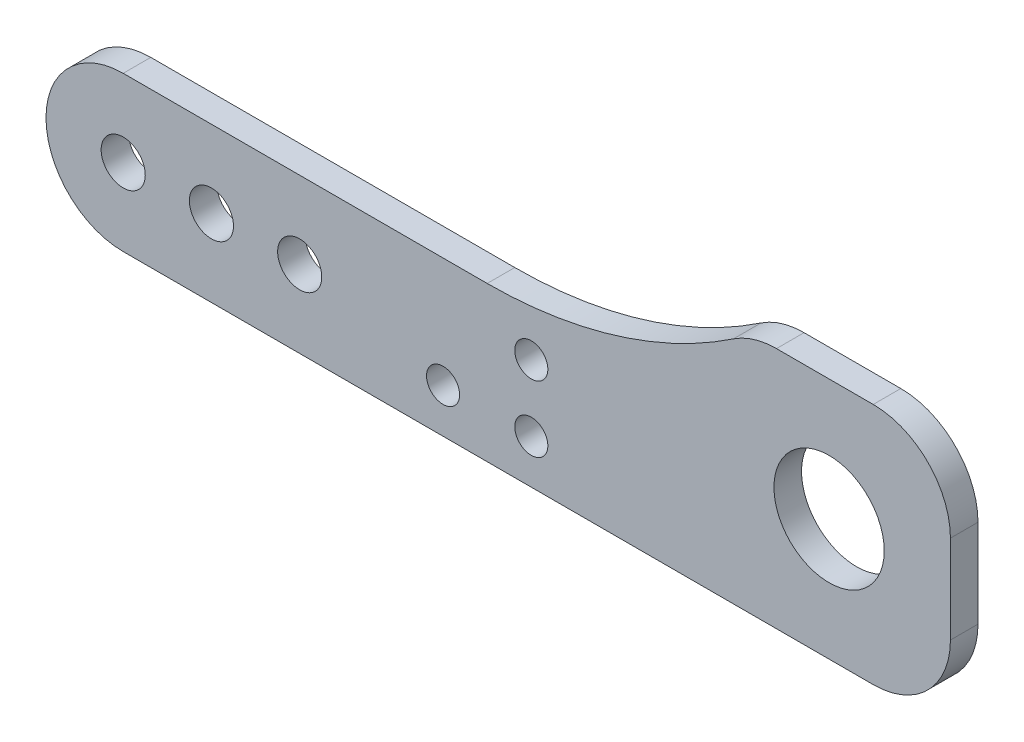
ISO-10303-21;
HEADER;
FILE_DESCRIPTION(('STEP AP214'),'2;1');
FILE_NAME('part.step','',(''),(''),'','','');
FILE_SCHEMA(('AUTOMOTIVE_DESIGN { 1 0 10303 214 1 1 1 1 }'));
ENDSEC;
DATA;
#1=APPLICATION_CONTEXT('core data for automotive mechanical design processes');
#2=APPLICATION_PROTOCOL_DEFINITION('international standard','automotive_design',2000,#1);
#3=PRODUCT_CONTEXT('',#1,'mechanical');
#4=PRODUCT('Part','Part','',(#3));
#5=PRODUCT_RELATED_PRODUCT_CATEGORY('part','',(#4));
#6=PRODUCT_DEFINITION_FORMATION('','',#4);
#7=PRODUCT_DEFINITION_CONTEXT('part definition',#1,'design');
#8=PRODUCT_DEFINITION('design','',#6,#7);
#9=PRODUCT_DEFINITION_SHAPE('','',#8);
#10=(LENGTH_UNIT() NAMED_UNIT(*) SI_UNIT(.MILLI.,.METRE.));
#11=(NAMED_UNIT(*) PLANE_ANGLE_UNIT() SI_UNIT($,.RADIAN.));
#12=(NAMED_UNIT(*) SI_UNIT($,.STERADIAN.) SOLID_ANGLE_UNIT());
#13=UNCERTAINTY_MEASURE_WITH_UNIT(LENGTH_MEASURE(1.E-05),#10,'distance_accuracy_value','');
#14=(GEOMETRIC_REPRESENTATION_CONTEXT(3) GLOBAL_UNCERTAINTY_ASSIGNED_CONTEXT((#13)) GLOBAL_UNIT_ASSIGNED_CONTEXT((#10,
#11,#12)) REPRESENTATION_CONTEXT('',''));
#15=CARTESIAN_POINT('',(0.,0.,0.));
#16=DIRECTION('',(0.,0.,1.));
#17=DIRECTION('',(1.,0.,0.));
#18=AXIS2_PLACEMENT_3D('',#15,#16,#17);
#19=CARTESIAN_POINT('',(68.,0.,2.5));
#20=DIRECTION('',(0.,0.,-1.));
#21=DIRECTION('',(-1.,0.,0.));
#22=AXIS2_PLACEMENT_3D('',#19,#20,#21);
#23=CYLINDRICAL_SURFACE('',#22,7.);
#24=CARTESIAN_POINT('',(68.,0.,0.));
#25=DIRECTION('',(0.,0.,1.));
#26=DIRECTION('',(1.,0.,0.));
#27=AXIS2_PLACEMENT_3D('',#24,#25,#26);
#28=CIRCLE('',#27,7.);
#29=CARTESIAN_POINT('',(68.,-6.99999999999999,0.));
#30=VERTEX_POINT('',#29);
#31=CARTESIAN_POINT('',(75.,0.,0.));
#32=VERTEX_POINT('',#31);
#33=EDGE_CURVE('E146',#30,#32,#28,.T.);
#34=ORIENTED_EDGE('',*,*,#33,.T.);
#35=DIRECTION('',(0.,0.,-1.));
#36=VECTOR('',#35,1.);
#37=CARTESIAN_POINT('',(75.,0.,2.5));
#38=LINE('',#37,#36);
#39=CARTESIAN_POINT('',(75.,0.,2.5));
#40=VERTEX_POINT('',#39);
#41=EDGE_CURVE('E11',#40,#32,#38,.T.);
#42=ORIENTED_EDGE('',*,*,#41,.F.);
#43=CARTESIAN_POINT('',(68.,0.,2.5));
#44=DIRECTION('',(0.,0.,1.));
#45=DIRECTION('',(1.,0.,0.));
#46=AXIS2_PLACEMENT_3D('',#43,#44,#45);
#47=CIRCLE('',#46,7.);
#48=CARTESIAN_POINT('',(68.,-6.99999999999999,2.5));
#49=VERTEX_POINT('',#48);
#50=EDGE_CURVE('E172',#49,#40,#47,.T.);
#51=ORIENTED_EDGE('',*,*,#50,.F.);
#52=DIRECTION('',(0.,0.,-1.));
#53=VECTOR('',#52,1.);
#54=CARTESIAN_POINT('',(68.,-6.99999999999999,2.5));
#55=LINE('',#54,#53);
#56=EDGE_CURVE('E142',#49,#30,#55,.T.);
#57=ORIENTED_EDGE('',*,*,#56,.T.);
#58=EDGE_LOOP('',(#34,#42,#51,#57));
#59=FACE_BOUND('',#58,.T.);
#60=ADVANCED_FACE('F39',(#59),#23,.T.);
#61=CARTESIAN_POINT('',(75.,0.,2.5));
#62=DIRECTION('',(-1.,0.,0.));
#63=DIRECTION('',(0.,-1.,0.));
#64=AXIS2_PLACEMENT_3D('',#61,#62,#63);
#65=PLANE('',#64);
#66=DIRECTION('',(0.,1.,0.));
#67=VECTOR('',#66,1.);
#68=CARTESIAN_POINT('',(75.,0.,0.));
#69=LINE('',#68,#67);
#70=CARTESIAN_POINT('',(75.,8.00000000000001,0.));
#71=VERTEX_POINT('',#70);
#72=EDGE_CURVE('E150',#32,#71,#69,.T.);
#73=ORIENTED_EDGE('',*,*,#72,.T.);
#74=DIRECTION('',(0.,0.,-1.));
#75=VECTOR('',#74,1.);
#76=CARTESIAN_POINT('',(75.,8.00000000000001,2.5));
#77=LINE('',#76,#75);
#78=CARTESIAN_POINT('',(75.,8.00000000000001,2.5));
#79=VERTEX_POINT('',#78);
#80=EDGE_CURVE('E48',#79,#71,#77,.T.);
#81=ORIENTED_EDGE('',*,*,#80,.F.);
#82=DIRECTION('',(0.,1.,0.));
#83=VECTOR('',#82,1.);
#84=CARTESIAN_POINT('',(75.,0.,2.5));
#85=LINE('',#84,#83);
#86=EDGE_CURVE('E102',#40,#79,#85,.T.);
#87=ORIENTED_EDGE('',*,*,#86,.F.);
#88=ORIENTED_EDGE('',*,*,#41,.T.);
#89=EDGE_LOOP('',(#73,#81,#87,#88));
#90=FACE_BOUND('',#89,.T.);
#91=ADVANCED_FACE('F316',(#90),#65,.F.);
#92=CARTESIAN_POINT('',(68.,8.00000000000001,2.5));
#93=DIRECTION('',(0.,0.,-1.));
#94=DIRECTION('',(-1.,0.,0.));
#95=AXIS2_PLACEMENT_3D('',#92,#93,#94);
#96=CYLINDRICAL_SURFACE('',#95,7.);
#97=CARTESIAN_POINT('',(68.,8.00000000000001,0.));
#98=DIRECTION('',(0.,0.,1.));
#99=DIRECTION('',(-1.,0.,0.));
#100=AXIS2_PLACEMENT_3D('',#97,#98,#99);
#101=CIRCLE('',#100,7.);
#102=CARTESIAN_POINT('',(68.,15.,0.));
#103=VERTEX_POINT('',#102);
#104=EDGE_CURVE('E154',#71,#103,#101,.T.);
#105=ORIENTED_EDGE('',*,*,#104,.T.);
#106=DIRECTION('',(0.,0.,-1.));
#107=VECTOR('',#106,1.);
#108=CARTESIAN_POINT('',(68.,15.,2.5));
#109=LINE('',#108,#107);
#110=CARTESIAN_POINT('',(68.,15.,2.5));
#111=VERTEX_POINT('',#110);
#112=EDGE_CURVE('E187',#111,#103,#109,.T.);
#113=ORIENTED_EDGE('',*,*,#112,.F.);
#114=CARTESIAN_POINT('',(68.,8.00000000000001,2.5));
#115=DIRECTION('',(0.,0.,1.));
#116=DIRECTION('',(-1.,0.,0.));
#117=AXIS2_PLACEMENT_3D('',#114,#115,#116);
#118=CIRCLE('',#117,7.);
#119=EDGE_CURVE('E197',#79,#111,#118,.T.);
#120=ORIENTED_EDGE('',*,*,#119,.F.);
#121=ORIENTED_EDGE('',*,*,#80,.T.);
#122=EDGE_LOOP('',(#105,#113,#120,#121));
#123=FACE_BOUND('',#122,.T.);
#124=ADVANCED_FACE('F195',(#123),#96,.T.);
#125=CARTESIAN_POINT('',(59.229754097208,15.,2.5));
#126=DIRECTION('',(0.,-1.,0.));
#127=DIRECTION('',(0.,0.,-1.));
#128=AXIS2_PLACEMENT_3D('',#125,#126,#127);
#129=PLANE('',#128);
#130=DIRECTION('',(-1.,0.,0.));
#131=VECTOR('',#130,1.);
#132=CARTESIAN_POINT('',(59.229754097208,15.,0.));
#133=LINE('',#132,#131);
#134=CARTESIAN_POINT('',(59.229754097208,15.,0.));
#135=VERTEX_POINT('',#134);
#136=EDGE_CURVE('E157',#103,#135,#133,.T.);
#137=ORIENTED_EDGE('',*,*,#136,.T.);
#138=DIRECTION('',(0.,0.,-1.));
#139=VECTOR('',#138,1.);
#140=CARTESIAN_POINT('',(59.229754097208,15.,2.5));
#141=LINE('',#140,#139);
#142=CARTESIAN_POINT('',(59.229754097208,15.,2.5));
#143=VERTEX_POINT('',#142);
#144=EDGE_CURVE('E183',#143,#135,#141,.T.);
#145=ORIENTED_EDGE('',*,*,#144,.F.);
#146=DIRECTION('',(-1.,0.,0.));
#147=VECTOR('',#146,1.);
#148=CARTESIAN_POINT('',(59.229754097208,15.,2.5));
#149=LINE('',#148,#147);
#150=EDGE_CURVE('E214',#111,#143,#149,.T.);
#151=ORIENTED_EDGE('',*,*,#150,.F.);
#152=ORIENTED_EDGE('',*,*,#112,.T.);
#153=EDGE_LOOP('',(#137,#145,#151,#152));
#154=FACE_BOUND('',#153,.T.);
#155=ADVANCED_FACE('F206',(#154),#129,.F.);
#156=CARTESIAN_POINT('',(59.229754097208,8.00000000000001,2.5));
#157=DIRECTION('',(0.,0.,-1.));
#158=DIRECTION('',(-1.,0.,0.));
#159=AXIS2_PLACEMENT_3D('',#156,#157,#158);
#160=CYLINDRICAL_SURFACE('',#159,7.);
#161=CARTESIAN_POINT('',(59.229754097208,8.00000000000001,0.));
#162=DIRECTION('',(0.,0.,1.));
#163=DIRECTION('',(1.,0.,0.));
#164=AXIS2_PLACEMENT_3D('',#161,#162,#163);
#165=CIRCLE('',#164,7.);
#166=CARTESIAN_POINT('',(55.3231949763472,13.8085106382979,0.));
#167=VERTEX_POINT('',#166);
#168=EDGE_CURVE('E160',#135,#167,#165,.T.);
#169=ORIENTED_EDGE('',*,*,#168,.T.);
#170=DIRECTION('',(0.,0.,-1.));
#171=VECTOR('',#170,1.);
#172=CARTESIAN_POINT('',(55.3231949763472,13.8085106382979,2.5));
#173=LINE('',#172,#171);
#174=CARTESIAN_POINT('',(55.3231949763472,13.8085106382979,2.5));
#175=VERTEX_POINT('',#174);
#176=EDGE_CURVE('E179',#175,#167,#173,.T.);
#177=ORIENTED_EDGE('',*,*,#176,.F.);
#178=CARTESIAN_POINT('',(59.229754097208,8.00000000000001,2.5));
#179=DIRECTION('',(0.,0.,1.));
#180=DIRECTION('',(1.,0.,0.));
#181=AXIS2_PLACEMENT_3D('',#178,#179,#180);
#182=CIRCLE('',#181,7.);
#183=EDGE_CURVE('E212',#143,#175,#182,.T.);
#184=ORIENTED_EDGE('',*,*,#183,.F.);
#185=ORIENTED_EDGE('',*,*,#144,.T.);
#186=EDGE_LOOP('',(#169,#177,#184,#185));
#187=FACE_BOUND('',#186,.T.);
#188=ADVANCED_FACE('F210',(#187),#160,.T.);
#189=CARTESIAN_POINT('',(33.,47.,2.5));
#190=DIRECTION('',(0.,0.,-1.));
#191=DIRECTION('',(-1.,0.,0.));
#192=AXIS2_PLACEMENT_3D('',#189,#190,#191);
#193=CYLINDRICAL_SURFACE('',#192,40.);
#194=CARTESIAN_POINT('',(33.,47.,0.));
#195=DIRECTION('',(0.,0.,-1.));
#196=DIRECTION('',(1.,0.,0.));
#197=AXIS2_PLACEMENT_3D('',#194,#195,#196);
#198=CIRCLE('',#197,40.);
#199=CARTESIAN_POINT('',(33.,7.,0.));
#200=VERTEX_POINT('',#199);
#201=EDGE_CURVE('E163',#167,#200,#198,.T.);
#202=ORIENTED_EDGE('',*,*,#201,.T.);
#203=DIRECTION('',(0.,0.,-1.));
#204=VECTOR('',#203,1.);
#205=CARTESIAN_POINT('',(33.,7.,2.5));
#206=LINE('',#205,#204);
#207=CARTESIAN_POINT('',(33.,7.,2.5));
#208=VERTEX_POINT('',#207);
#209=EDGE_CURVE('E135',#208,#200,#206,.T.);
#210=ORIENTED_EDGE('',*,*,#209,.F.);
#211=CARTESIAN_POINT('',(33.,47.,2.5));
#212=DIRECTION('',(0.,0.,-1.));
#213=DIRECTION('',(1.,0.,0.));
#214=AXIS2_PLACEMENT_3D('',#211,#212,#213);
#215=CIRCLE('',#214,40.);
#216=EDGE_CURVE('E124',#175,#208,#215,.T.);
#217=ORIENTED_EDGE('',*,*,#216,.F.);
#218=ORIENTED_EDGE('',*,*,#176,.T.);
#219=EDGE_LOOP('',(#202,#210,#217,#218));
#220=FACE_BOUND('',#219,.T.);
#221=ADVANCED_FACE('F324',(#220),#193,.F.);
#222=CARTESIAN_POINT('',(0.,7.,2.5));
#223=DIRECTION('',(0.,-1.,0.));
#224=DIRECTION('',(1.,0.,0.));
#225=AXIS2_PLACEMENT_3D('',#222,#223,#224);
#226=PLANE('',#225);
#227=DIRECTION('',(-1.,0.,0.));
#228=VECTOR('',#227,1.);
#229=CARTESIAN_POINT('',(0.,7.,0.));
#230=LINE('',#229,#228);
#231=CARTESIAN_POINT('',(0.,7.,0.));
#232=VERTEX_POINT('',#231);
#233=EDGE_CURVE('E133',#200,#232,#230,.T.);
#234=ORIENTED_EDGE('',*,*,#233,.T.);
#235=DIRECTION('',(0.,0.,-1.));
#236=VECTOR('',#235,1.);
#237=CARTESIAN_POINT('',(0.,7.,2.5));
#238=LINE('',#237,#236);
#239=CARTESIAN_POINT('',(0.,7.,2.5));
#240=VERTEX_POINT('',#239);
#241=EDGE_CURVE('E130',#240,#232,#238,.T.);
#242=ORIENTED_EDGE('',*,*,#241,.F.);
#243=DIRECTION('',(-1.,0.,0.));
#244=VECTOR('',#243,1.);
#245=CARTESIAN_POINT('',(0.,7.,2.5));
#246=LINE('',#245,#244);
#247=EDGE_CURVE('E118',#208,#240,#246,.T.);
#248=ORIENTED_EDGE('',*,*,#247,.F.);
#249=ORIENTED_EDGE('',*,*,#209,.T.);
#250=EDGE_LOOP('',(#234,#242,#248,#249));
#251=FACE_BOUND('',#250,.T.);
#252=ADVANCED_FACE('F131',(#251),#226,.F.);
#253=CARTESIAN_POINT('',(0.,0.,2.5));
#254=DIRECTION('',(0.,0.,-1.));
#255=DIRECTION('',(-1.,0.,0.));
#256=AXIS2_PLACEMENT_3D('',#253,#254,#255);
#257=CYLINDRICAL_SURFACE('',#256,7.);
#258=CARTESIAN_POINT('',(0.,0.,0.));
#259=DIRECTION('',(0.,0.,1.));
#260=DIRECTION('',(-1.,0.,0.));
#261=AXIS2_PLACEMENT_3D('',#258,#259,#260);
#262=CIRCLE('',#261,7.);
#263=CARTESIAN_POINT('',(0.,-7.,0.));
#264=VERTEX_POINT('',#263);
#265=EDGE_CURVE('E88',#232,#264,#262,.T.);
#266=ORIENTED_EDGE('',*,*,#265,.T.);
#267=DIRECTION('',(0.,0.,-1.));
#268=VECTOR('',#267,1.);
#269=CARTESIAN_POINT('',(0.,-7.,2.5));
#270=LINE('',#269,#268);
#271=CARTESIAN_POINT('',(0.,-7.,2.5));
#272=VERTEX_POINT('',#271);
#273=EDGE_CURVE('E136',#272,#264,#270,.T.);
#274=ORIENTED_EDGE('',*,*,#273,.F.);
#275=CARTESIAN_POINT('',(0.,0.,2.5));
#276=DIRECTION('',(0.,0.,1.));
#277=DIRECTION('',(-1.,0.,0.));
#278=AXIS2_PLACEMENT_3D('',#275,#276,#277);
#279=CIRCLE('',#278,7.);
#280=EDGE_CURVE('E122',#240,#272,#279,.T.);
#281=ORIENTED_EDGE('',*,*,#280,.F.);
#282=ORIENTED_EDGE('',*,*,#241,.T.);
#283=EDGE_LOOP('',(#266,#274,#281,#282));
#284=FACE_BOUND('',#283,.T.);
#285=ADVANCED_FACE('F138',(#284),#257,.T.);
#286=CARTESIAN_POINT('',(68.,-6.99999999999999,2.5));
#287=DIRECTION('',(0.,1.,0.));
#288=DIRECTION('',(-1.,0.,0.));
#289=AXIS2_PLACEMENT_3D('',#286,#287,#288);
#290=PLANE('',#289);
#291=DIRECTION('',(1.,0.,0.));
#292=VECTOR('',#291,1.);
#293=CARTESIAN_POINT('',(68.,-6.99999999999999,0.));
#294=LINE('',#293,#292);
#295=EDGE_CURVE('E94',#264,#30,#294,.T.);
#296=ORIENTED_EDGE('',*,*,#295,.T.);
#297=ORIENTED_EDGE('',*,*,#56,.F.);
#298=DIRECTION('',(1.,0.,0.));
#299=VECTOR('',#298,1.);
#300=CARTESIAN_POINT('',(68.,-6.99999999999999,2.5));
#301=LINE('',#300,#299);
#302=EDGE_CURVE('E56',#272,#49,#301,.T.);
#303=ORIENTED_EDGE('',*,*,#302,.F.);
#304=ORIENTED_EDGE('',*,*,#273,.T.);
#305=EDGE_LOOP('',(#296,#297,#303,#304));
#306=FACE_BOUND('',#305,.T.);
#307=ADVANCED_FACE('F307',(#306),#290,.F.);
#308=CARTESIAN_POINT('',(68.,0.,2.5));
#309=DIRECTION('',(0.,0.,1.));
#310=DIRECTION('',(1.,0.,0.));
#311=AXIS2_PLACEMENT_3D('',#308,#309,#310);
#312=PLANE('',#311);
#313=CARTESIAN_POINT('',(37.,2.99999999999984,2.5));
#314=DIRECTION('',(0.,0.,-1.));
#315=DIRECTION('',(-1.,0.,0.));
#316=AXIS2_PLACEMENT_3D('',#313,#314,#315);
#317=CIRCLE('',#316,1.5);
#318=CARTESIAN_POINT('',(35.5,2.99999999999984,2.5));
#319=VERTEX_POINT('',#318);
#320=EDGE_CURVE('E273',#319,#319,#317,.T.);
#321=ORIENTED_EDGE('',*,*,#320,.T.);
#322=EDGE_LOOP('',(#321));
#323=FACE_BOUND('',#322,.T.);
#324=CARTESIAN_POINT('',(37.,-3.00000000000016,2.5));
#325=DIRECTION('',(0.,0.,-1.));
#326=DIRECTION('',(-1.,0.,0.));
#327=AXIS2_PLACEMENT_3D('',#324,#325,#326);
#328=CIRCLE('',#327,1.5);
#329=CARTESIAN_POINT('',(35.5,-3.00000000000016,2.5));
#330=VERTEX_POINT('',#329);
#331=EDGE_CURVE('E265',#330,#330,#328,.T.);
#332=ORIENTED_EDGE('',*,*,#331,.T.);
#333=EDGE_LOOP('',(#332));
#334=FACE_BOUND('',#333,.T.);
#335=CARTESIAN_POINT('',(29.,-3.00000000000016,2.5));
#336=DIRECTION('',(0.,0.,-1.));
#337=DIRECTION('',(-1.,0.,0.));
#338=AXIS2_PLACEMENT_3D('',#335,#336,#337);
#339=CIRCLE('',#338,1.5);
#340=CARTESIAN_POINT('',(27.5,-3.00000000000016,2.5));
#341=VERTEX_POINT('',#340);
#342=EDGE_CURVE('E257',#341,#341,#339,.T.);
#343=ORIENTED_EDGE('',*,*,#342,.T.);
#344=EDGE_LOOP('',(#343));
#345=FACE_BOUND('',#344,.T.);
#346=CARTESIAN_POINT('',(64.,4.00000000000001,2.5));
#347=DIRECTION('',(0.,0.,1.));
#348=DIRECTION('',(1.,0.,0.));
#349=AXIS2_PLACEMENT_3D('',#346,#347,#348);
#350=CIRCLE('',#349,5.);
#351=CARTESIAN_POINT('',(69.,4.00000000000001,2.5));
#352=VERTEX_POINT('',#351);
#353=EDGE_CURVE('E253',#352,#352,#350,.T.);
#354=ORIENTED_EDGE('',*,*,#353,.F.);
#355=EDGE_LOOP('',(#354));
#356=FACE_BOUND('',#355,.T.);
#357=CARTESIAN_POINT('',(0.,0.,2.5));
#358=DIRECTION('',(0.,0.,1.));
#359=DIRECTION('',(1.,0.,0.));
#360=AXIS2_PLACEMENT_3D('',#357,#358,#359);
#361=CIRCLE('',#360,2.);
#362=CARTESIAN_POINT('',(2.,0.,2.5));
#363=VERTEX_POINT('',#362);
#364=EDGE_CURVE('E240',#363,#363,#361,.T.);
#365=ORIENTED_EDGE('',*,*,#364,.F.);
#366=EDGE_LOOP('',(#365));
#367=FACE_BOUND('',#366,.T.);
#368=CARTESIAN_POINT('',(8.,0.,2.5));
#369=DIRECTION('',(0.,0.,1.));
#370=DIRECTION('',(1.,0.,0.));
#371=AXIS2_PLACEMENT_3D('',#368,#369,#370);
#372=CIRCLE('',#371,2.);
#373=CARTESIAN_POINT('',(10.,0.,2.5));
#374=VERTEX_POINT('',#373);
#375=EDGE_CURVE('E230',#374,#374,#372,.T.);
#376=ORIENTED_EDGE('',*,*,#375,.F.);
#377=EDGE_LOOP('',(#376));
#378=FACE_BOUND('',#377,.T.);
#379=CARTESIAN_POINT('',(16.,0.,2.5));
#380=DIRECTION('',(0.,0.,1.));
#381=DIRECTION('',(1.,0.,0.));
#382=AXIS2_PLACEMENT_3D('',#379,#380,#381);
#383=CIRCLE('',#382,2.);
#384=CARTESIAN_POINT('',(18.,0.,2.5));
#385=VERTEX_POINT('',#384);
#386=EDGE_CURVE('E231',#385,#385,#383,.T.);
#387=ORIENTED_EDGE('',*,*,#386,.F.);
#388=EDGE_LOOP('',(#387));
#389=FACE_BOUND('',#388,.T.);
#390=ORIENTED_EDGE('',*,*,#50,.T.);
#391=ORIENTED_EDGE('',*,*,#86,.T.);
#392=ORIENTED_EDGE('',*,*,#119,.T.);
#393=ORIENTED_EDGE('',*,*,#150,.T.);
#394=ORIENTED_EDGE('',*,*,#183,.T.);
#395=ORIENTED_EDGE('',*,*,#216,.T.);
#396=ORIENTED_EDGE('',*,*,#247,.T.);
#397=ORIENTED_EDGE('',*,*,#280,.T.);
#398=ORIENTED_EDGE('',*,*,#302,.T.);
#399=EDGE_LOOP('',(#390,#391,#392,#393,#394,#395,#396,#397,#398));
#400=FACE_BOUND('',#399,.T.);
#401=ADVANCED_FACE('F120',(#323,#334,#345,#356,#367,#378,#389,#400),#312,.T.);
#402=CARTESIAN_POINT('',(68.,0.,0.));
#403=DIRECTION('',(0.,0.,1.));
#404=DIRECTION('',(1.,0.,0.));
#405=AXIS2_PLACEMENT_3D('',#402,#403,#404);
#406=PLANE('',#405);
#407=CARTESIAN_POINT('',(37.,2.99999999999984,0.));
#408=DIRECTION('',(0.,0.,-1.));
#409=DIRECTION('',(-1.,0.,0.));
#410=AXIS2_PLACEMENT_3D('',#407,#408,#409);
#411=CIRCLE('',#410,1.5);
#412=CARTESIAN_POINT('',(35.5,2.99999999999984,0.));
#413=VERTEX_POINT('',#412);
#414=EDGE_CURVE('E277',#413,#413,#411,.T.);
#415=ORIENTED_EDGE('',*,*,#414,.F.);
#416=EDGE_LOOP('',(#415));
#417=FACE_BOUND('',#416,.T.);
#418=CARTESIAN_POINT('',(37.,-3.00000000000016,0.));
#419=DIRECTION('',(0.,0.,-1.));
#420=DIRECTION('',(-1.,0.,0.));
#421=AXIS2_PLACEMENT_3D('',#418,#419,#420);
#422=CIRCLE('',#421,1.5);
#423=CARTESIAN_POINT('',(35.5,-3.00000000000016,0.));
#424=VERTEX_POINT('',#423);
#425=EDGE_CURVE('E269',#424,#424,#422,.T.);
#426=ORIENTED_EDGE('',*,*,#425,.F.);
#427=EDGE_LOOP('',(#426));
#428=FACE_BOUND('',#427,.T.);
#429=CARTESIAN_POINT('',(29.,-3.00000000000016,0.));
#430=DIRECTION('',(0.,0.,-1.));
#431=DIRECTION('',(-1.,0.,0.));
#432=AXIS2_PLACEMENT_3D('',#429,#430,#431);
#433=CIRCLE('',#432,1.5);
#434=CARTESIAN_POINT('',(27.5,-3.00000000000016,0.));
#435=VERTEX_POINT('',#434);
#436=EDGE_CURVE('E261',#435,#435,#433,.T.);
#437=ORIENTED_EDGE('',*,*,#436,.F.);
#438=EDGE_LOOP('',(#437));
#439=FACE_BOUND('',#438,.T.);
#440=CARTESIAN_POINT('',(64.,4.00000000000001,0.));
#441=DIRECTION('',(0.,0.,1.));
#442=DIRECTION('',(1.,0.,0.));
#443=AXIS2_PLACEMENT_3D('',#440,#441,#442);
#444=CIRCLE('',#443,5.);
#445=CARTESIAN_POINT('',(69.,4.00000000000001,0.));
#446=VERTEX_POINT('',#445);
#447=EDGE_CURVE('E235',#446,#446,#444,.F.);
#448=ORIENTED_EDGE('',*,*,#447,.F.);
#449=EDGE_LOOP('',(#448));
#450=FACE_BOUND('',#449,.T.);
#451=CARTESIAN_POINT('',(0.,0.,0.));
#452=DIRECTION('',(0.,0.,1.));
#453=DIRECTION('',(1.,0.,0.));
#454=AXIS2_PLACEMENT_3D('',#451,#452,#453);
#455=CIRCLE('',#454,2.);
#456=CARTESIAN_POINT('',(2.,0.,0.));
#457=VERTEX_POINT('',#456);
#458=EDGE_CURVE('E151',#457,#457,#455,.F.);
#459=ORIENTED_EDGE('',*,*,#458,.F.);
#460=EDGE_LOOP('',(#459));
#461=FACE_BOUND('',#460,.T.);
#462=CARTESIAN_POINT('',(8.,0.,0.));
#463=DIRECTION('',(0.,0.,1.));
#464=DIRECTION('',(1.,0.,0.));
#465=AXIS2_PLACEMENT_3D('',#462,#463,#464);
#466=CIRCLE('',#465,2.);
#467=CARTESIAN_POINT('',(10.,0.,0.));
#468=VERTEX_POINT('',#467);
#469=EDGE_CURVE('E236',#468,#468,#466,.F.);
#470=ORIENTED_EDGE('',*,*,#469,.F.);
#471=EDGE_LOOP('',(#470));
#472=FACE_BOUND('',#471,.T.);
#473=CARTESIAN_POINT('',(16.,0.,0.));
#474=DIRECTION('',(0.,0.,1.));
#475=DIRECTION('',(1.,0.,0.));
#476=AXIS2_PLACEMENT_3D('',#473,#474,#475);
#477=CIRCLE('',#476,2.);
#478=CARTESIAN_POINT('',(18.,0.,0.));
#479=VERTEX_POINT('',#478);
#480=EDGE_CURVE('E226',#479,#479,#477,.F.);
#481=ORIENTED_EDGE('',*,*,#480,.F.);
#482=EDGE_LOOP('',(#481));
#483=FACE_BOUND('',#482,.T.);
#484=ORIENTED_EDGE('',*,*,#33,.F.);
#485=ORIENTED_EDGE('',*,*,#295,.F.);
#486=ORIENTED_EDGE('',*,*,#265,.F.);
#487=ORIENTED_EDGE('',*,*,#233,.F.);
#488=ORIENTED_EDGE('',*,*,#201,.F.);
#489=ORIENTED_EDGE('',*,*,#168,.F.);
#490=ORIENTED_EDGE('',*,*,#136,.F.);
#491=ORIENTED_EDGE('',*,*,#104,.F.);
#492=ORIENTED_EDGE('',*,*,#72,.F.);
#493=EDGE_LOOP('',(#484,#485,#486,#487,#488,#489,#490,#491,#492));
#494=FACE_BOUND('',#493,.T.);
#495=ADVANCED_FACE('F201',(#417,#428,#439,#450,#461,#472,#483,#494),#406,.F.);
#496=CARTESIAN_POINT('',(16.,0.,-5.65685424949239));
#497=DIRECTION('',(0.,0.,1.));
#498=DIRECTION('',(1.,0.,0.));
#499=AXIS2_PLACEMENT_3D('',#496,#497,#498);
#500=CYLINDRICAL_SURFACE('',#499,2.);
#501=ORIENTED_EDGE('',*,*,#480,.T.);
#502=EDGE_LOOP('',(#501));
#503=FACE_BOUND('',#502,.T.);
#504=ORIENTED_EDGE('',*,*,#386,.T.);
#505=EDGE_LOOP('',(#504));
#506=FACE_BOUND('',#505,.T.);
#507=ADVANCED_FACE('F286',(#503,#506),#500,.F.);
#508=CARTESIAN_POINT('',(8.,0.,-5.65685424949239));
#509=DIRECTION('',(0.,0.,1.));
#510=DIRECTION('',(1.,0.,0.));
#511=AXIS2_PLACEMENT_3D('',#508,#509,#510);
#512=CYLINDRICAL_SURFACE('',#511,2.);
#513=ORIENTED_EDGE('',*,*,#469,.T.);
#514=EDGE_LOOP('',(#513));
#515=FACE_BOUND('',#514,.T.);
#516=ORIENTED_EDGE('',*,*,#375,.T.);
#517=EDGE_LOOP('',(#516));
#518=FACE_BOUND('',#517,.T.);
#519=ADVANCED_FACE('F302',(#515,#518),#512,.F.);
#520=CARTESIAN_POINT('',(0.,0.,-5.65685424949239));
#521=DIRECTION('',(0.,0.,1.));
#522=DIRECTION('',(1.,0.,0.));
#523=AXIS2_PLACEMENT_3D('',#520,#521,#522);
#524=CYLINDRICAL_SURFACE('',#523,2.);
#525=ORIENTED_EDGE('',*,*,#458,.T.);
#526=EDGE_LOOP('',(#525));
#527=FACE_BOUND('',#526,.T.);
#528=ORIENTED_EDGE('',*,*,#364,.T.);
#529=EDGE_LOOP('',(#528));
#530=FACE_BOUND('',#529,.T.);
#531=ADVANCED_FACE('F390',(#527,#530),#524,.F.);
#532=CARTESIAN_POINT('',(64.,4.00000000000001,-14.142135623731));
#533=DIRECTION('',(0.,0.,1.));
#534=DIRECTION('',(1.,0.,0.));
#535=AXIS2_PLACEMENT_3D('',#532,#533,#534);
#536=CYLINDRICAL_SURFACE('',#535,5.);
#537=ORIENTED_EDGE('',*,*,#447,.T.);
#538=EDGE_LOOP('',(#537));
#539=FACE_BOUND('',#538,.T.);
#540=ORIENTED_EDGE('',*,*,#353,.T.);
#541=EDGE_LOOP('',(#540));
#542=FACE_BOUND('',#541,.T.);
#543=ADVANCED_FACE('F400',(#539,#542),#536,.F.);
#544=CARTESIAN_POINT('',(29.,-3.00000000000016,0.));
#545=DIRECTION('',(0.,0.,-1.));
#546=DIRECTION('',(-1.,0.,0.));
#547=AXIS2_PLACEMENT_3D('',#544,#545,#546);
#548=CYLINDRICAL_SURFACE('',#547,1.5);
#549=ORIENTED_EDGE('',*,*,#342,.F.);
#550=EDGE_LOOP('',(#549));
#551=FACE_BOUND('',#550,.T.);
#552=ORIENTED_EDGE('',*,*,#436,.T.);
#553=EDGE_LOOP('',(#552));
#554=FACE_BOUND('',#553,.T.);
#555=ADVANCED_FACE('F409',(#551,#554),#548,.F.);
#556=CARTESIAN_POINT('',(37.,-3.00000000000016,0.));
#557=DIRECTION('',(0.,0.,-1.));
#558=DIRECTION('',(-1.,0.,0.));
#559=AXIS2_PLACEMENT_3D('',#556,#557,#558);
#560=CYLINDRICAL_SURFACE('',#559,1.5);
#561=ORIENTED_EDGE('',*,*,#331,.F.);
#562=EDGE_LOOP('',(#561));
#563=FACE_BOUND('',#562,.T.);
#564=ORIENTED_EDGE('',*,*,#425,.T.);
#565=EDGE_LOOP('',(#564));
#566=FACE_BOUND('',#565,.T.);
#567=ADVANCED_FACE('F428',(#563,#566),#560,.F.);
#568=CARTESIAN_POINT('',(37.,2.99999999999984,0.));
#569=DIRECTION('',(0.,0.,-1.));
#570=DIRECTION('',(-1.,0.,0.));
#571=AXIS2_PLACEMENT_3D('',#568,#569,#570);
#572=CYLINDRICAL_SURFACE('',#571,1.5);
#573=ORIENTED_EDGE('',*,*,#320,.F.);
#574=EDGE_LOOP('',(#573));
#575=FACE_BOUND('',#574,.T.);
#576=ORIENTED_EDGE('',*,*,#414,.T.);
#577=EDGE_LOOP('',(#576));
#578=FACE_BOUND('',#577,.T.);
#579=ADVANCED_FACE('F282',(#575,#578),#572,.F.);
#580=CLOSED_SHELL('',(#60,#91,#124,#155,#188,#221,#252,#285,#307,#401,#495,#507,#519,#531,#543,
#555,#567,#579));
#581=MANIFOLD_SOLID_BREP('B2',#580);
#582=ADVANCED_BREP_SHAPE_REPRESENTATION('',(#18,#581),#14);
#583=SHAPE_DEFINITION_REPRESENTATION(#9,#582);
ENDSEC;
END-ISO-10303-21;
